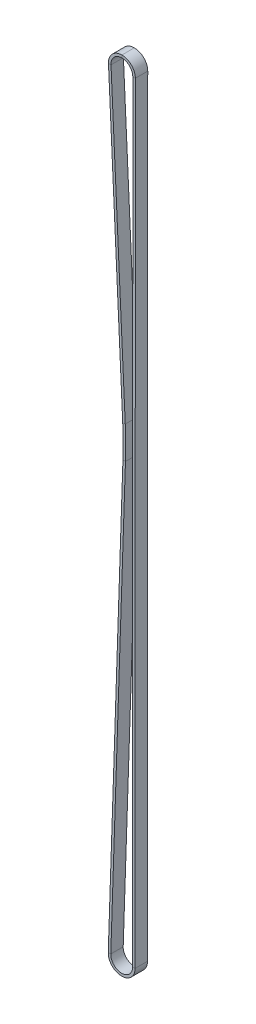
ISO-10303-21;
HEADER;
FILE_DESCRIPTION(('STEP AP214'),'2;1');
FILE_NAME('part.step','',(''),(''),'','','');
FILE_SCHEMA(('AUTOMOTIVE_DESIGN { 1 0 10303 214 1 1 1 1 }'));
ENDSEC;
DATA;
#1=APPLICATION_CONTEXT('core data for automotive mechanical design processes');
#2=APPLICATION_PROTOCOL_DEFINITION('international standard','automotive_design',2000,#1);
#3=PRODUCT_CONTEXT('',#1,'mechanical');
#4=PRODUCT('Part','Part','',(#3));
#5=PRODUCT_RELATED_PRODUCT_CATEGORY('part','',(#4));
#6=PRODUCT_DEFINITION_FORMATION('','',#4);
#7=PRODUCT_DEFINITION_CONTEXT('part definition',#1,'design');
#8=PRODUCT_DEFINITION('design','',#6,#7);
#9=PRODUCT_DEFINITION_SHAPE('','',#8);
#10=(LENGTH_UNIT() NAMED_UNIT(*) SI_UNIT(.MILLI.,.METRE.));
#11=(NAMED_UNIT(*) PLANE_ANGLE_UNIT() SI_UNIT($,.RADIAN.));
#12=(NAMED_UNIT(*) SI_UNIT($,.STERADIAN.) SOLID_ANGLE_UNIT());
#13=UNCERTAINTY_MEASURE_WITH_UNIT(LENGTH_MEASURE(1.E-05),#10,'distance_accuracy_value','');
#14=(GEOMETRIC_REPRESENTATION_CONTEXT(3) GLOBAL_UNCERTAINTY_ASSIGNED_CONTEXT((#13)) GLOBAL_UNIT_ASSIGNED_CONTEXT((#10,
#11,#12)) REPRESENTATION_CONTEXT('',''));
#15=CARTESIAN_POINT('',(0.,0.,0.));
#16=DIRECTION('',(0.,0.,1.));
#17=DIRECTION('',(1.,0.,0.));
#18=AXIS2_PLACEMENT_3D('',#15,#16,#17);
#19=CARTESIAN_POINT('',(0.,0.,0.));
#20=DIRECTION('',(0.,0.,-1.));
#21=DIRECTION('',(-1.,0.,0.));
#22=AXIS2_PLACEMENT_3D('',#19,#20,#21);
#23=CYLINDRICAL_SURFACE('',#22,7.96805699758778);
#24=CARTESIAN_POINT('',(0.,0.,0.));
#25=DIRECTION('',(0.,0.,-1.));
#26=DIRECTION('',(-0.998903282982742,-0.0468212691658441,0.));
#27=AXIS2_PLACEMENT_3D('',#24,#25,#26);
#28=CIRCLE('',#27,7.96805699758778);
#29=CARTESIAN_POINT('',(-7.95931829388405,-0.37307454141286,0.));
#30=VERTEX_POINT('',#29);
#31=CARTESIAN_POINT('',(0.,7.96805699758778,0.));
#32=VERTEX_POINT('',#31);
#33=EDGE_CURVE('E11',#30,#32,#28,.T.);
#34=ORIENTED_EDGE('',*,*,#33,.F.);
#35=DIRECTION('',(0.,0.,1.));
#36=VECTOR('',#35,1.);
#37=CARTESIAN_POINT('',(-7.95931829388405,-0.373074541412847,7.366));
#38=LINE('',#37,#36);
#39=CARTESIAN_POINT('',(-7.95931829388405,-0.37307454141286,7.366));
#40=VERTEX_POINT('',#39);
#41=EDGE_CURVE('E36',#30,#40,#38,.T.);
#42=ORIENTED_EDGE('',*,*,#41,.T.);
#43=CARTESIAN_POINT('',(0.,0.,7.366));
#44=DIRECTION('',(0.,0.,-1.));
#45=DIRECTION('',(-0.998903282982742,-0.0468212691658441,0.));
#46=AXIS2_PLACEMENT_3D('',#43,#44,#45);
#47=CIRCLE('',#46,7.96805699758778);
#48=CARTESIAN_POINT('',(0.,7.96805699758778,7.366));
#49=VERTEX_POINT('',#48);
#50=EDGE_CURVE('E157',#40,#49,#47,.T.);
#51=ORIENTED_EDGE('',*,*,#50,.T.);
#52=DIRECTION('',(0.,0.,1.));
#53=VECTOR('',#52,1.);
#54=CARTESIAN_POINT('',(0.,7.96805699758778,7.366));
#55=LINE('',#54,#53);
#56=EDGE_CURVE('E160',#32,#49,#55,.T.);
#57=ORIENTED_EDGE('',*,*,#56,.F.);
#58=EDGE_LOOP('',(#34,#42,#51,#57));
#59=FACE_BOUND('',#58,.T.);
#60=ADVANCED_FACE('F33',(#59),#23,.T.);
#61=CARTESIAN_POINT('',(-7.95931829388405,-0.373074541412845,0.));
#62=DIRECTION('',(0.,0.,-1.));
#63=DIRECTION('',(-1.,0.,0.));
#64=AXIS2_PLACEMENT_3D('',#61,#62,#63);
#65=PLANE('',#64);
#66=CARTESIAN_POINT('',(0.,0.,0.));
#67=DIRECTION('',(0.,0.,-1.));
#68=DIRECTION('',(-0.998903282982742,-0.0468212691658441,0.));
#69=AXIS2_PLACEMENT_3D('',#66,#67,#68);
#70=CIRCLE('',#69,6.46805699758778);
#71=CARTESIAN_POINT('',(-6.46096336940993,-0.302842637664086,0.));
#72=VERTEX_POINT('',#71);
#73=CARTESIAN_POINT('',(0.,6.46805699758778,0.));
#74=VERTEX_POINT('',#73);
#75=EDGE_CURVE('E41',#72,#74,#70,.T.);
#76=ORIENTED_EDGE('',*,*,#75,.F.);
#77=DIRECTION('',(-0.998903282982742,-0.0468212691658444,0.));
#78=VECTOR('',#77,1.);
#79=CARTESIAN_POINT('',(-7.95931829388405,-0.373074541412847,0.));
#80=LINE('',#79,#78);
#81=EDGE_CURVE('E276',#72,#30,#80,.T.);
#82=ORIENTED_EDGE('',*,*,#81,.T.);
#83=ORIENTED_EDGE('',*,*,#33,.T.);
#84=DIRECTION('',(0.,1.,0.));
#85=VECTOR('',#84,1.);
#86=CARTESIAN_POINT('',(0.,7.96805699758778,0.));
#87=LINE('',#86,#85);
#88=EDGE_CURVE('E185',#74,#32,#87,.T.);
#89=ORIENTED_EDGE('',*,*,#88,.F.);
#90=EDGE_LOOP('',(#76,#82,#83,#89));
#91=FACE_BOUND('',#90,.T.);
#92=ADVANCED_FACE('F371',(#91),#65,.T.);
#93=CARTESIAN_POINT('',(0.,0.,0.));
#94=DIRECTION('',(0.,0.,-1.));
#95=DIRECTION('',(-1.,0.,0.));
#96=AXIS2_PLACEMENT_3D('',#93,#94,#95);
#97=CYLINDRICAL_SURFACE('',#96,6.46805699758778);
#98=CARTESIAN_POINT('',(0.,0.,7.366));
#99=DIRECTION('',(0.,0.,-1.));
#100=DIRECTION('',(-0.998903282982742,-0.0468212691658441,0.));
#101=AXIS2_PLACEMENT_3D('',#98,#99,#100);
#102=CIRCLE('',#101,6.46805699758778);
#103=CARTESIAN_POINT('',(-6.46096336940993,-0.302842637664086,7.366));
#104=VERTEX_POINT('',#103);
#105=CARTESIAN_POINT('',(0.,6.46805699758778,7.366));
#106=VERTEX_POINT('',#105);
#107=EDGE_CURVE('E166',#104,#106,#102,.T.);
#108=ORIENTED_EDGE('',*,*,#107,.F.);
#109=DIRECTION('',(0.,0.,-1.));
#110=VECTOR('',#109,1.);
#111=CARTESIAN_POINT('',(-6.46096336940993,-0.302842637664081,7.366));
#112=LINE('',#111,#110);
#113=EDGE_CURVE('E244',#104,#72,#112,.T.);
#114=ORIENTED_EDGE('',*,*,#113,.T.);
#115=ORIENTED_EDGE('',*,*,#75,.T.);
#116=DIRECTION('',(0.,0.,-1.));
#117=VECTOR('',#116,1.);
#118=CARTESIAN_POINT('',(0.,6.46805699758778,7.366));
#119=LINE('',#118,#117);
#120=EDGE_CURVE('E189',#106,#74,#119,.T.);
#121=ORIENTED_EDGE('',*,*,#120,.F.);
#122=EDGE_LOOP('',(#108,#114,#115,#121));
#123=FACE_BOUND('',#122,.T.);
#124=ADVANCED_FACE('F375',(#123),#97,.F.);
#125=CARTESIAN_POINT('',(0.490311873554149,-180.640791854833,7.366));
#126=DIRECTION('',(-0.998903282982742,-0.0468212691658445,0.));
#127=DIRECTION('',(0.0468212691658445,-0.998903282982742,0.));
#128=AXIS2_PLACEMENT_3D('',#125,#126,#127);
#129=PLANE('',#128);
#130=ORIENTED_EDGE('',*,*,#41,.F.);
#131=DIRECTION('',(-0.0468212691658445,0.998903282982742,0.));
#132=VECTOR('',#131,1.);
#133=CARTESIAN_POINT('',(0.490311873554151,-180.640791854833,0.));
#134=LINE('',#133,#132);
#135=CARTESIAN_POINT('',(0.490311873554222,-180.640791854833,0.));
#136=VERTEX_POINT('',#135);
#137=EDGE_CURVE('E92',#136,#30,#134,.T.);
#138=ORIENTED_EDGE('',*,*,#137,.F.);
#139=DIRECTION('',(0.,0.,1.));
#140=VECTOR('',#139,1.);
#141=CARTESIAN_POINT('',(0.490311873554179,-180.640791854833,7.366));
#142=LINE('',#141,#140);
#143=CARTESIAN_POINT('',(0.490311873554222,-180.640791854833,7.366));
#144=VERTEX_POINT('',#143);
#145=EDGE_CURVE('E247',#136,#144,#142,.T.);
#146=ORIENTED_EDGE('',*,*,#145,.T.);
#147=DIRECTION('',(-0.0468212691658445,0.998903282982742,0.));
#148=VECTOR('',#147,1.);
#149=CARTESIAN_POINT('',(0.490311873554149,-180.640791854833,7.366));
#150=LINE('',#149,#148);
#151=EDGE_CURVE('E242',#144,#40,#150,.T.);
#152=ORIENTED_EDGE('',*,*,#151,.T.);
#153=EDGE_LOOP('',(#130,#138,#146,#152));
#154=FACE_BOUND('',#153,.T.);
#155=ADVANCED_FACE('F308',(#154),#129,.T.);
#156=CARTESIAN_POINT('',(0.490311873554151,-180.640791854833,0.));
#157=DIRECTION('',(0.,0.,-1.));
#158=DIRECTION('',(-1.,0.,0.));
#159=AXIS2_PLACEMENT_3D('',#156,#157,#158);
#160=PLANE('',#159);
#161=ORIENTED_EDGE('',*,*,#137,.T.);
#162=ORIENTED_EDGE('',*,*,#81,.F.);
#163=DIRECTION('',(-0.0468212691658445,0.998903282982742,0.));
#164=VECTOR('',#163,1.);
#165=CARTESIAN_POINT('',(1.98866679802826,-180.570559951085,0.));
#166=LINE('',#165,#164);
#167=CARTESIAN_POINT('',(1.98866679802831,-180.570559951085,0.));
#168=VERTEX_POINT('',#167);
#169=EDGE_CURVE('E101',#168,#72,#166,.T.);
#170=ORIENTED_EDGE('',*,*,#169,.F.);
#171=DIRECTION('',(-0.998903282982742,-0.0468212691658443,0.));
#172=VECTOR('',#171,1.);
#173=CARTESIAN_POINT('',(0.490311873554181,-180.640791854833,0.));
#174=LINE('',#173,#172);
#175=EDGE_CURVE('E272',#168,#136,#174,.T.);
#176=ORIENTED_EDGE('',*,*,#175,.T.);
#177=EDGE_LOOP('',(#161,#162,#170,#176));
#178=FACE_BOUND('',#177,.T.);
#179=ADVANCED_FACE('F383',(#178),#160,.T.);
#180=CARTESIAN_POINT('',(1.98866679802826,-180.570559951085,7.366));
#181=DIRECTION('',(0.998903282982742,0.0468212691658445,0.));
#182=DIRECTION('',(-0.0468212691658445,0.998903282982742,0.));
#183=AXIS2_PLACEMENT_3D('',#180,#181,#182);
#184=PLANE('',#183);
#185=ORIENTED_EDGE('',*,*,#169,.T.);
#186=ORIENTED_EDGE('',*,*,#113,.F.);
#187=DIRECTION('',(-0.0468212691658445,0.998903282982742,0.));
#188=VECTOR('',#187,1.);
#189=CARTESIAN_POINT('',(1.98866679802826,-180.570559951085,7.366));
#190=LINE('',#189,#188);
#191=CARTESIAN_POINT('',(1.98866679802831,-180.570559951085,7.366));
#192=VERTEX_POINT('',#191);
#193=EDGE_CURVE('E109',#192,#104,#190,.T.);
#194=ORIENTED_EDGE('',*,*,#193,.F.);
#195=DIRECTION('',(0.,0.,-1.));
#196=VECTOR('',#195,1.);
#197=CARTESIAN_POINT('',(1.98866679802829,-180.570559951085,7.366));
#198=LINE('',#197,#196);
#199=EDGE_CURVE('E236',#192,#168,#198,.T.);
#200=ORIENTED_EDGE('',*,*,#199,.T.);
#201=EDGE_LOOP('',(#185,#186,#194,#200));
#202=FACE_BOUND('',#201,.T.);
#203=ADVANCED_FACE('F399',(#202),#184,.T.);
#204=CARTESIAN_POINT('',(0.490311873554149,-180.640791854833,7.366));
#205=DIRECTION('',(0.,0.,1.));
#206=DIRECTION('',(1.,0.,0.));
#207=AXIS2_PLACEMENT_3D('',#204,#205,#206);
#208=PLANE('',#207);
#209=ORIENTED_EDGE('',*,*,#193,.T.);
#210=DIRECTION('',(0.998903282982742,0.0468212691658444,0.));
#211=VECTOR('',#210,1.);
#212=CARTESIAN_POINT('',(-7.95931829388405,-0.373074541412847,7.366));
#213=LINE('',#212,#211);
#214=EDGE_CURVE('E240',#40,#104,#213,.T.);
#215=ORIENTED_EDGE('',*,*,#214,.F.);
#216=ORIENTED_EDGE('',*,*,#151,.F.);
#217=DIRECTION('',(0.998903282982742,0.0468212691658443,0.));
#218=VECTOR('',#217,1.);
#219=CARTESIAN_POINT('',(0.490311873554179,-180.640791854833,7.366));
#220=LINE('',#219,#218);
#221=EDGE_CURVE('E231',#144,#192,#220,.T.);
#222=ORIENTED_EDGE('',*,*,#221,.T.);
#223=EDGE_LOOP('',(#209,#215,#216,#222));
#224=FACE_BOUND('',#223,.T.);
#225=ADVANCED_FACE('F394',(#224),#208,.T.);
#226=CARTESIAN_POINT('',(-235.126,-191.684758719327,0.));
#227=DIRECTION('',(0.,0.,1.));
#228=DIRECTION('',(1.,0.,0.));
#229=AXIS2_PLACEMENT_3D('',#226,#227,#228);
#230=CYLINDRICAL_SURFACE('',#229,235.875);
#231=ORIENTED_EDGE('',*,*,#145,.F.);
#232=CARTESIAN_POINT('',(-235.126,-191.684758719327,0.));
#233=DIRECTION('',(0.,0.,1.));
#234=DIRECTION('',(0.999428102416468,-0.0338152051630405,0.));
#235=AXIS2_PLACEMENT_3D('',#232,#233,#234);
#236=CIRCLE('',#235,235.875);
#237=CARTESIAN_POINT('',(0.61410365748428,-199.660920237159,0.));
#238=VERTEX_POINT('',#237);
#239=EDGE_CURVE('E295',#238,#136,#236,.T.);
#240=ORIENTED_EDGE('',*,*,#239,.F.);
#241=DIRECTION('',(0.,0.,1.));
#242=VECTOR('',#241,1.);
#243=CARTESIAN_POINT('',(0.614103657484282,-199.660920237159,7.366));
#244=LINE('',#243,#242);
#245=CARTESIAN_POINT('',(0.614103657484277,-199.660920237159,7.366));
#246=VERTEX_POINT('',#245);
#247=EDGE_CURVE('E239',#238,#246,#244,.T.);
#248=ORIENTED_EDGE('',*,*,#247,.T.);
#249=CARTESIAN_POINT('',(-235.126,-191.684758719327,7.366));
#250=DIRECTION('',(0.,0.,1.));
#251=DIRECTION('',(0.999428102416468,-0.0338152051630405,0.));
#252=AXIS2_PLACEMENT_3D('',#249,#250,#251);
#253=CIRCLE('',#252,235.875);
#254=EDGE_CURVE('E234',#246,#144,#253,.T.);
#255=ORIENTED_EDGE('',*,*,#254,.T.);
#256=EDGE_LOOP('',(#231,#240,#248,#255));
#257=FACE_BOUND('',#256,.T.);
#258=ADVANCED_FACE('F313',(#257),#230,.F.);
#259=CARTESIAN_POINT('',(0.61410365748431,-199.660920237159,0.));
#260=DIRECTION('',(0.,0.,-1.));
#261=DIRECTION('',(-1.,0.,0.));
#262=AXIS2_PLACEMENT_3D('',#259,#260,#261);
#263=PLANE('',#262);
#264=ORIENTED_EDGE('',*,*,#239,.T.);
#265=ORIENTED_EDGE('',*,*,#175,.F.);
#266=CARTESIAN_POINT('',(-235.126,-191.684758719327,0.));
#267=DIRECTION('',(0.,0.,1.));
#268=DIRECTION('',(0.999428102416468,-0.0338152051630406,0.));
#269=AXIS2_PLACEMENT_3D('',#266,#267,#268);
#270=CIRCLE('',#269,237.375);
#271=CARTESIAN_POINT('',(2.11324581110898,-199.711643044904,0.));
#272=VERTEX_POINT('',#271);
#273=EDGE_CURVE('E130',#272,#168,#270,.T.);
#274=ORIENTED_EDGE('',*,*,#273,.F.);
#275=DIRECTION('',(-0.999428102416468,0.0338152051630414,0.));
#276=VECTOR('',#275,1.);
#277=CARTESIAN_POINT('',(0.614103657484284,-199.660920237159,0.));
#278=LINE('',#277,#276);
#279=EDGE_CURVE('E269',#272,#238,#278,.T.);
#280=ORIENTED_EDGE('',*,*,#279,.T.);
#281=EDGE_LOOP('',(#264,#265,#274,#280));
#282=FACE_BOUND('',#281,.T.);
#283=ADVANCED_FACE('F393',(#282),#263,.T.);
#284=CARTESIAN_POINT('',(-235.126,-191.684758719327,0.));
#285=DIRECTION('',(0.,0.,1.));
#286=DIRECTION('',(1.,0.,0.));
#287=AXIS2_PLACEMENT_3D('',#284,#285,#286);
#288=CYLINDRICAL_SURFACE('',#287,237.375);
#289=ORIENTED_EDGE('',*,*,#273,.T.);
#290=ORIENTED_EDGE('',*,*,#199,.F.);
#291=CARTESIAN_POINT('',(-235.126,-191.684758719327,7.366));
#292=DIRECTION('',(0.,0.,1.));
#293=DIRECTION('',(0.999428102416468,-0.0338152051630406,0.));
#294=AXIS2_PLACEMENT_3D('',#291,#292,#293);
#295=CIRCLE('',#294,237.375);
#296=CARTESIAN_POINT('',(2.11324581110898,-199.711643044904,7.366));
#297=VERTEX_POINT('',#296);
#298=EDGE_CURVE('E136',#297,#192,#295,.T.);
#299=ORIENTED_EDGE('',*,*,#298,.F.);
#300=DIRECTION('',(0.,0.,-1.));
#301=VECTOR('',#300,1.);
#302=CARTESIAN_POINT('',(2.11324581110898,-199.711643044904,7.366));
#303=LINE('',#302,#301);
#304=EDGE_CURVE('E227',#297,#272,#303,.T.);
#305=ORIENTED_EDGE('',*,*,#304,.T.);
#306=EDGE_LOOP('',(#289,#290,#299,#305));
#307=FACE_BOUND('',#306,.T.);
#308=ADVANCED_FACE('F404',(#307),#288,.T.);
#309=CARTESIAN_POINT('',(0.614103657484308,-199.660920237159,7.366));
#310=DIRECTION('',(0.,0.,1.));
#311=DIRECTION('',(1.,0.,0.));
#312=AXIS2_PLACEMENT_3D('',#309,#310,#311);
#313=PLANE('',#312);
#314=ORIENTED_EDGE('',*,*,#298,.T.);
#315=ORIENTED_EDGE('',*,*,#221,.F.);
#316=ORIENTED_EDGE('',*,*,#254,.F.);
#317=DIRECTION('',(0.999428102416468,-0.0338152051630414,0.));
#318=VECTOR('',#317,1.);
#319=CARTESIAN_POINT('',(0.614103657484282,-199.660920237159,7.366));
#320=LINE('',#319,#318);
#321=EDGE_CURVE('E220',#246,#297,#320,.T.);
#322=ORIENTED_EDGE('',*,*,#321,.T.);
#323=EDGE_LOOP('',(#314,#315,#316,#322));
#324=FACE_BOUND('',#323,.T.);
#325=ADVANCED_FACE('F311',(#324),#313,.T.);
#326=CARTESIAN_POINT('',(-8.09050008504552,-456.930558517875,7.366));
#327=DIRECTION('',(-0.999428102416468,0.0338152051630413,0.));
#328=DIRECTION('',(-0.0338152051630413,-0.999428102416468,0.));
#329=AXIS2_PLACEMENT_3D('',#326,#327,#328);
#330=PLANE('',#329);
#331=ORIENTED_EDGE('',*,*,#247,.F.);
#332=DIRECTION('',(0.0338152051630413,0.999428102416468,0.));
#333=VECTOR('',#332,1.);
#334=CARTESIAN_POINT('',(-8.09050008504551,-456.930558517875,0.));
#335=LINE('',#334,#333);
#336=CARTESIAN_POINT('',(-8.09050008504551,-456.930558517876,0.));
#337=VERTEX_POINT('',#336);
#338=EDGE_CURVE('E291',#337,#238,#335,.T.);
#339=ORIENTED_EDGE('',*,*,#338,.F.);
#340=DIRECTION('',(0.,0.,1.));
#341=VECTOR('',#340,1.);
#342=CARTESIAN_POINT('',(-8.09050008504552,-456.930558517876,7.366));
#343=LINE('',#342,#341);
#344=CARTESIAN_POINT('',(-8.09050008504552,-456.930558517876,7.366));
#345=VERTEX_POINT('',#344);
#346=EDGE_CURVE('E230',#337,#345,#343,.T.);
#347=ORIENTED_EDGE('',*,*,#346,.T.);
#348=DIRECTION('',(0.0338152051630413,0.999428102416468,0.));
#349=VECTOR('',#348,1.);
#350=CARTESIAN_POINT('',(-8.09050008504552,-456.930558517875,7.366));
#351=LINE('',#350,#349);
#352=EDGE_CURVE('E224',#345,#246,#351,.T.);
#353=ORIENTED_EDGE('',*,*,#352,.T.);
#354=EDGE_LOOP('',(#331,#339,#347,#353));
#355=FACE_BOUND('',#354,.T.);
#356=ADVANCED_FACE('F322',(#355),#330,.T.);
#357=CARTESIAN_POINT('',(-8.09050008504551,-456.930558517875,0.));
#358=DIRECTION('',(0.,0.,-1.));
#359=DIRECTION('',(-1.,0.,0.));
#360=AXIS2_PLACEMENT_3D('',#357,#358,#359);
#361=PLANE('',#360);
#362=ORIENTED_EDGE('',*,*,#338,.T.);
#363=ORIENTED_EDGE('',*,*,#279,.F.);
#364=DIRECTION('',(0.0338152051630413,0.999428102416468,0.));
#365=VECTOR('',#364,1.);
#366=CARTESIAN_POINT('',(-6.59135793142081,-456.98128132562,0.));
#367=LINE('',#366,#365);
#368=CARTESIAN_POINT('',(-6.59135793142081,-456.98128132562,0.));
#369=VERTEX_POINT('',#368);
#370=EDGE_CURVE('E266',#369,#272,#367,.T.);
#371=ORIENTED_EDGE('',*,*,#370,.F.);
#372=DIRECTION('',(-0.999428102416468,0.0338152051630392,0.));
#373=VECTOR('',#372,1.);
#374=CARTESIAN_POINT('',(-8.09050008504551,-456.930558517876,0.));
#375=LINE('',#374,#373);
#376=EDGE_CURVE('E263',#369,#337,#375,.T.);
#377=ORIENTED_EDGE('',*,*,#376,.T.);
#378=EDGE_LOOP('',(#362,#363,#371,#377));
#379=FACE_BOUND('',#378,.T.);
#380=ADVANCED_FACE('F340',(#379),#361,.T.);
#381=CARTESIAN_POINT('',(-6.59135793142081,-456.98128132562,7.366));
#382=DIRECTION('',(0.999428102416468,-0.0338152051630413,0.));
#383=DIRECTION('',(0.0338152051630413,0.999428102416468,0.));
#384=AXIS2_PLACEMENT_3D('',#381,#382,#383);
#385=PLANE('',#384);
#386=ORIENTED_EDGE('',*,*,#370,.T.);
#387=ORIENTED_EDGE('',*,*,#304,.F.);
#388=DIRECTION('',(0.0338152051630413,0.999428102416468,0.));
#389=VECTOR('',#388,1.);
#390=CARTESIAN_POINT('',(-6.59135793142081,-456.98128132562,7.366));
#391=LINE('',#390,#389);
#392=CARTESIAN_POINT('',(-6.59135793142081,-456.98128132562,7.366));
#393=VERTEX_POINT('',#392);
#394=EDGE_CURVE('E223',#393,#297,#391,.T.);
#395=ORIENTED_EDGE('',*,*,#394,.F.);
#396=DIRECTION('',(0.,0.,-1.));
#397=VECTOR('',#396,1.);
#398=CARTESIAN_POINT('',(-6.59135793142081,-456.98128132562,7.366));
#399=LINE('',#398,#397);
#400=EDGE_CURVE('E212',#393,#369,#399,.T.);
#401=ORIENTED_EDGE('',*,*,#400,.T.);
#402=EDGE_LOOP('',(#386,#387,#395,#401));
#403=FACE_BOUND('',#402,.T.);
#404=ADVANCED_FACE('F333',(#403),#385,.T.);
#405=CARTESIAN_POINT('',(-8.09050008504552,-456.930558517875,7.366));
#406=DIRECTION('',(0.,0.,1.));
#407=DIRECTION('',(1.,0.,0.));
#408=AXIS2_PLACEMENT_3D('',#405,#406,#407);
#409=PLANE('',#408);
#410=ORIENTED_EDGE('',*,*,#394,.T.);
#411=ORIENTED_EDGE('',*,*,#321,.F.);
#412=ORIENTED_EDGE('',*,*,#352,.F.);
#413=DIRECTION('',(0.999428102416468,-0.0338152051630392,0.));
#414=VECTOR('',#413,1.);
#415=CARTESIAN_POINT('',(-8.09050008504552,-456.930558517876,7.366));
#416=LINE('',#415,#414);
#417=EDGE_CURVE('E209',#345,#393,#416,.T.);
#418=ORIENTED_EDGE('',*,*,#417,.T.);
#419=EDGE_LOOP('',(#410,#411,#412,#418));
#420=FACE_BOUND('',#419,.T.);
#421=ADVANCED_FACE('F320',(#420),#409,.T.);
#422=CARTESIAN_POINT('',(-0.127000000000099,-457.2,0.));
#423=DIRECTION('',(0.,0.,-1.));
#424=DIRECTION('',(-1.,0.,0.));
#425=AXIS2_PLACEMENT_3D('',#422,#423,#424);
#426=CYLINDRICAL_SURFACE('',#425,7.96805699758778);
#427=ORIENTED_EDGE('',*,*,#346,.F.);
#428=CARTESIAN_POINT('',(-0.127000000000099,-457.2,0.));
#429=DIRECTION('',(0.,0.,-1.));
#430=DIRECTION('',(0.999999961419755,-0.000277777767063725,0.));
#431=AXIS2_PLACEMENT_3D('',#428,#429,#430);
#432=CIRCLE('',#431,7.96805699758778);
#433=CARTESIAN_POINT('',(7.84105669017809,-457.20221334908,0.));
#434=VERTEX_POINT('',#433);
#435=EDGE_CURVE('E213',#434,#337,#432,.T.);
#436=ORIENTED_EDGE('',*,*,#435,.F.);
#437=DIRECTION('',(0.,0.,1.));
#438=VECTOR('',#437,1.);
#439=CARTESIAN_POINT('',(7.8410566901781,-457.20221334908,7.366));
#440=LINE('',#439,#438);
#441=CARTESIAN_POINT('',(7.8410566901781,-457.20221334908,7.366));
#442=VERTEX_POINT('',#441);
#443=EDGE_CURVE('E219',#434,#442,#440,.T.);
#444=ORIENTED_EDGE('',*,*,#443,.T.);
#445=CARTESIAN_POINT('',(-0.127000000000099,-457.2,7.366));
#446=DIRECTION('',(0.,0.,-1.));
#447=DIRECTION('',(0.999999961419755,-0.000277777767063725,0.));
#448=AXIS2_PLACEMENT_3D('',#445,#446,#447);
#449=CIRCLE('',#448,7.96805699758778);
#450=EDGE_CURVE('E217',#442,#345,#449,.T.);
#451=ORIENTED_EDGE('',*,*,#450,.T.);
#452=EDGE_LOOP('',(#427,#436,#444,#451));
#453=FACE_BOUND('',#452,.T.);
#454=ADVANCED_FACE('F343',(#453),#426,.T.);
#455=CARTESIAN_POINT('',(7.84105669017809,-457.20221334908,0.));
#456=DIRECTION('',(0.,0.,-1.));
#457=DIRECTION('',(-1.,0.,0.));
#458=AXIS2_PLACEMENT_3D('',#455,#456,#457);
#459=PLANE('',#458);
#460=ORIENTED_EDGE('',*,*,#435,.T.);
#461=ORIENTED_EDGE('',*,*,#376,.F.);
#462=CARTESIAN_POINT('',(-0.127000000000099,-457.2,0.));
#463=DIRECTION('',(0.,0.,-1.));
#464=DIRECTION('',(0.999999961419755,-0.000277777767058919,0.));
#465=AXIS2_PLACEMENT_3D('',#462,#463,#464);
#466=CIRCLE('',#465,6.46805699758778);
#467=CARTESIAN_POINT('',(6.34105674804846,-457.20179668243,0.));
#468=VERTEX_POINT('',#467);
#469=EDGE_CURVE('E216',#468,#369,#466,.T.);
#470=ORIENTED_EDGE('',*,*,#469,.F.);
#471=DIRECTION('',(0.999999961419755,-0.000277777767061444,0.));
#472=VECTOR('',#471,1.);
#473=CARTESIAN_POINT('',(7.84105669017809,-457.20221334908,0.));
#474=LINE('',#473,#472);
#475=EDGE_CURVE('E260',#468,#434,#474,.T.);
#476=ORIENTED_EDGE('',*,*,#475,.T.);
#477=EDGE_LOOP('',(#460,#461,#470,#476));
#478=FACE_BOUND('',#477,.T.);
#479=ADVANCED_FACE('F341',(#478),#459,.T.);
#480=CARTESIAN_POINT('',(-0.127000000000099,-457.2,0.));
#481=DIRECTION('',(0.,0.,-1.));
#482=DIRECTION('',(-1.,0.,0.));
#483=AXIS2_PLACEMENT_3D('',#480,#481,#482);
#484=CYLINDRICAL_SURFACE('',#483,6.46805699758778);
#485=ORIENTED_EDGE('',*,*,#469,.T.);
#486=ORIENTED_EDGE('',*,*,#400,.F.);
#487=CARTESIAN_POINT('',(-0.127000000000099,-457.2,7.366));
#488=DIRECTION('',(0.,0.,-1.));
#489=DIRECTION('',(0.999999961419755,-0.000277777767058919,0.));
#490=AXIS2_PLACEMENT_3D('',#487,#488,#489);
#491=CIRCLE('',#490,6.46805699758778);
#492=CARTESIAN_POINT('',(6.34105674804846,-457.20179668243,7.366));
#493=VERTEX_POINT('',#492);
#494=EDGE_CURVE('E214',#493,#393,#491,.T.);
#495=ORIENTED_EDGE('',*,*,#494,.F.);
#496=DIRECTION('',(0.,0.,-1.));
#497=VECTOR('',#496,1.);
#498=CARTESIAN_POINT('',(6.34105674804846,-457.20179668243,7.366));
#499=LINE('',#498,#497);
#500=EDGE_CURVE('E205',#493,#468,#499,.T.);
#501=ORIENTED_EDGE('',*,*,#500,.T.);
#502=EDGE_LOOP('',(#485,#486,#495,#501));
#503=FACE_BOUND('',#502,.T.);
#504=ADVANCED_FACE('F334',(#503),#484,.F.);
#505=CARTESIAN_POINT('',(7.8410566901781,-457.20221334908,7.366));
#506=DIRECTION('',(0.,0.,1.));
#507=DIRECTION('',(1.,0.,0.));
#508=AXIS2_PLACEMENT_3D('',#505,#506,#507);
#509=PLANE('',#508);
#510=ORIENTED_EDGE('',*,*,#494,.T.);
#511=ORIENTED_EDGE('',*,*,#417,.F.);
#512=ORIENTED_EDGE('',*,*,#450,.F.);
#513=DIRECTION('',(-0.999999961419755,0.000277777767061444,0.));
#514=VECTOR('',#513,1.);
#515=CARTESIAN_POINT('',(7.8410566901781,-457.20221334908,7.366));
#516=LINE('',#515,#514);
#517=EDGE_CURVE('E198',#442,#493,#516,.T.);
#518=ORIENTED_EDGE('',*,*,#517,.T.);
#519=EDGE_LOOP('',(#510,#511,#512,#518));
#520=FACE_BOUND('',#519,.T.);
#521=ADVANCED_FACE('F327',(#520),#509,.T.);
#522=CARTESIAN_POINT('',(7.9680566901782,-0.00221334908060825,7.366));
#523=DIRECTION('',(0.999999961419755,-0.00027777776706126,0.));
#524=DIRECTION('',(0.00027777776706126,0.999999961419755,0.));
#525=AXIS2_PLACEMENT_3D('',#522,#523,#524);
#526=PLANE('',#525);
#527=ORIENTED_EDGE('',*,*,#443,.F.);
#528=DIRECTION('',(-0.00027777776706126,-0.999999961419755,0.));
#529=VECTOR('',#528,1.);
#530=CARTESIAN_POINT('',(7.96805669017819,-0.00221334908060825,0.));
#531=LINE('',#530,#529);
#532=CARTESIAN_POINT('',(7.96805669017819,-0.00221334908048623,0.));
#533=VERTEX_POINT('',#532);
#534=EDGE_CURVE('E284',#533,#434,#531,.T.);
#535=ORIENTED_EDGE('',*,*,#534,.F.);
#536=DIRECTION('',(0.,0.,1.));
#537=VECTOR('',#536,1.);
#538=CARTESIAN_POINT('',(7.9680566901782,-0.00221334908048642,7.366));
#539=LINE('',#538,#537);
#540=CARTESIAN_POINT('',(7.9680566901782,-0.00221334908048623,7.366));
#541=VERTEX_POINT('',#540);
#542=EDGE_CURVE('E208',#533,#541,#539,.T.);
#543=ORIENTED_EDGE('',*,*,#542,.T.);
#544=DIRECTION('',(-0.00027777776706126,-0.999999961419755,0.));
#545=VECTOR('',#544,1.);
#546=CARTESIAN_POINT('',(7.9680566901782,-0.00221334908060825,7.366));
#547=LINE('',#546,#545);
#548=EDGE_CURVE('E202',#541,#442,#547,.T.);
#549=ORIENTED_EDGE('',*,*,#548,.T.);
#550=EDGE_LOOP('',(#527,#535,#543,#549));
#551=FACE_BOUND('',#550,.T.);
#552=ADVANCED_FACE('F345',(#551),#526,.T.);
#553=CARTESIAN_POINT('',(7.96805669017819,-0.00221334908060825,0.));
#554=DIRECTION('',(0.,0.,-1.));
#555=DIRECTION('',(-1.,0.,0.));
#556=AXIS2_PLACEMENT_3D('',#553,#554,#555);
#557=PLANE('',#556);
#558=ORIENTED_EDGE('',*,*,#534,.T.);
#559=ORIENTED_EDGE('',*,*,#475,.F.);
#560=DIRECTION('',(-0.00027777776706126,-0.999999961419755,0.));
#561=VECTOR('',#560,1.);
#562=CARTESIAN_POINT('',(6.46805674804856,-0.00179668243001608,0.));
#563=LINE('',#562,#561);
#564=CARTESIAN_POINT('',(6.46805674804856,-0.00179668242991704,0.));
#565=VERTEX_POINT('',#564);
#566=EDGE_CURVE('E257',#565,#468,#563,.T.);
#567=ORIENTED_EDGE('',*,*,#566,.F.);
#568=DIRECTION('',(0.999999961419755,-0.000277777767046154,0.));
#569=VECTOR('',#568,1.);
#570=CARTESIAN_POINT('',(7.96805669017819,-0.00221334908048642,0.));
#571=LINE('',#570,#569);
#572=EDGE_CURVE('E254',#565,#533,#571,.T.);
#573=ORIENTED_EDGE('',*,*,#572,.T.);
#574=EDGE_LOOP('',(#558,#559,#567,#573));
#575=FACE_BOUND('',#574,.T.);
#576=ADVANCED_FACE('F347',(#575),#557,.T.);
#577=CARTESIAN_POINT('',(6.46805674804856,-0.00179668243001608,7.366));
#578=DIRECTION('',(-0.999999961419755,0.00027777776706126,0.));
#579=DIRECTION('',(-0.00027777776706126,-0.999999961419755,0.));
#580=AXIS2_PLACEMENT_3D('',#577,#578,#579);
#581=PLANE('',#580);
#582=ORIENTED_EDGE('',*,*,#566,.T.);
#583=ORIENTED_EDGE('',*,*,#500,.F.);
#584=DIRECTION('',(-0.00027777776706126,-0.999999961419755,0.));
#585=VECTOR('',#584,1.);
#586=CARTESIAN_POINT('',(6.46805674804856,-0.00179668243001608,7.366));
#587=LINE('',#586,#585);
#588=CARTESIAN_POINT('',(6.46805674804856,-0.00179668242991704,7.366));
#589=VERTEX_POINT('',#588);
#590=EDGE_CURVE('E201',#589,#493,#587,.T.);
#591=ORIENTED_EDGE('',*,*,#590,.F.);
#592=DIRECTION('',(0.,0.,-1.));
#593=VECTOR('',#592,1.);
#594=CARTESIAN_POINT('',(6.46805674804856,-0.00179668242991718,7.366));
#595=LINE('',#594,#593);
#596=EDGE_CURVE('E196',#589,#565,#595,.T.);
#597=ORIENTED_EDGE('',*,*,#596,.T.);
#598=EDGE_LOOP('',(#582,#583,#591,#597));
#599=FACE_BOUND('',#598,.T.);
#600=ADVANCED_FACE('F357',(#599),#581,.T.);
#601=CARTESIAN_POINT('',(7.9680566901782,-0.00221334908060825,7.366));
#602=DIRECTION('',(0.,0.,1.));
#603=DIRECTION('',(1.,0.,0.));
#604=AXIS2_PLACEMENT_3D('',#601,#602,#603);
#605=PLANE('',#604);
#606=ORIENTED_EDGE('',*,*,#590,.T.);
#607=ORIENTED_EDGE('',*,*,#517,.F.);
#608=ORIENTED_EDGE('',*,*,#548,.F.);
#609=DIRECTION('',(-0.999999961419755,0.000277777767046154,0.));
#610=VECTOR('',#609,1.);
#611=CARTESIAN_POINT('',(7.9680566901782,-0.00221334908048642,7.366));
#612=LINE('',#611,#610);
#613=EDGE_CURVE('E177',#541,#589,#612,.T.);
#614=ORIENTED_EDGE('',*,*,#613,.T.);
#615=EDGE_LOOP('',(#606,#607,#608,#614));
#616=FACE_BOUND('',#615,.T.);
#617=ADVANCED_FACE('F359',(#616),#605,.T.);
#618=CARTESIAN_POINT('',(0.,0.,0.));
#619=DIRECTION('',(0.,0.,-1.));
#620=DIRECTION('',(-1.,0.,0.));
#621=AXIS2_PLACEMENT_3D('',#618,#619,#620);
#622=CYLINDRICAL_SURFACE('',#621,7.96805699758778);
#623=ORIENTED_EDGE('',*,*,#542,.F.);
#624=CARTESIAN_POINT('',(0.,0.,0.));
#625=DIRECTION('',(0.,0.,-1.));
#626=DIRECTION('',(0.,1.,0.));
#627=AXIS2_PLACEMENT_3D('',#624,#625,#626);
#628=CIRCLE('',#627,7.96805699758778);
#629=EDGE_CURVE('E184',#32,#533,#628,.T.);
#630=ORIENTED_EDGE('',*,*,#629,.F.);
#631=ORIENTED_EDGE('',*,*,#56,.T.);
#632=CARTESIAN_POINT('',(0.,0.,7.366));
#633=DIRECTION('',(0.,0.,-1.));
#634=DIRECTION('',(0.,1.,0.));
#635=AXIS2_PLACEMENT_3D('',#632,#633,#634);
#636=CIRCLE('',#635,7.96805699758778);
#637=EDGE_CURVE('E172',#49,#541,#636,.T.);
#638=ORIENTED_EDGE('',*,*,#637,.T.);
#639=EDGE_LOOP('',(#623,#630,#631,#638));
#640=FACE_BOUND('',#639,.T.);
#641=ADVANCED_FACE('F182',(#640),#622,.T.);
#642=CARTESIAN_POINT('',(0.,7.96805699758778,0.));
#643=DIRECTION('',(0.,0.,-1.));
#644=DIRECTION('',(-1.,0.,0.));
#645=AXIS2_PLACEMENT_3D('',#642,#643,#644);
#646=PLANE('',#645);
#647=ORIENTED_EDGE('',*,*,#629,.T.);
#648=ORIENTED_EDGE('',*,*,#572,.F.);
#649=CARTESIAN_POINT('',(0.,0.,0.));
#650=DIRECTION('',(0.,0.,-1.));
#651=DIRECTION('',(0.,1.,0.));
#652=AXIS2_PLACEMENT_3D('',#649,#650,#651);
#653=CIRCLE('',#652,6.46805699758778);
#654=EDGE_CURVE('E251',#74,#565,#653,.T.);
#655=ORIENTED_EDGE('',*,*,#654,.F.);
#656=ORIENTED_EDGE('',*,*,#88,.T.);
#657=EDGE_LOOP('',(#647,#648,#655,#656));
#658=FACE_BOUND('',#657,.T.);
#659=ADVANCED_FACE('F351',(#658),#646,.T.);
#660=CARTESIAN_POINT('',(0.,0.,0.));
#661=DIRECTION('',(0.,0.,-1.));
#662=DIRECTION('',(-1.,0.,0.));
#663=AXIS2_PLACEMENT_3D('',#660,#661,#662);
#664=CYLINDRICAL_SURFACE('',#663,6.46805699758778);
#665=ORIENTED_EDGE('',*,*,#654,.T.);
#666=ORIENTED_EDGE('',*,*,#596,.F.);
#667=CARTESIAN_POINT('',(0.,0.,7.366));
#668=DIRECTION('',(0.,0.,-1.));
#669=DIRECTION('',(0.,1.,0.));
#670=AXIS2_PLACEMENT_3D('',#667,#668,#669);
#671=CIRCLE('',#670,6.46805699758778);
#672=EDGE_CURVE('E195',#106,#589,#671,.T.);
#673=ORIENTED_EDGE('',*,*,#672,.F.);
#674=ORIENTED_EDGE('',*,*,#120,.T.);
#675=EDGE_LOOP('',(#665,#666,#673,#674));
#676=FACE_BOUND('',#675,.T.);
#677=ADVANCED_FACE('F354',(#676),#664,.F.);
#678=CARTESIAN_POINT('',(0.,7.96805699758778,7.366));
#679=DIRECTION('',(0.,0.,1.));
#680=DIRECTION('',(1.,0.,0.));
#681=AXIS2_PLACEMENT_3D('',#678,#679,#680);
#682=PLANE('',#681);
#683=ORIENTED_EDGE('',*,*,#672,.T.);
#684=ORIENTED_EDGE('',*,*,#613,.F.);
#685=ORIENTED_EDGE('',*,*,#637,.F.);
#686=DIRECTION('',(0.,-1.,0.));
#687=VECTOR('',#686,1.);
#688=CARTESIAN_POINT('',(0.,7.96805699758778,7.366));
#689=LINE('',#688,#687);
#690=EDGE_CURVE('E175',#49,#106,#689,.T.);
#691=ORIENTED_EDGE('',*,*,#690,.T.);
#692=EDGE_LOOP('',(#683,#684,#685,#691));
#693=FACE_BOUND('',#692,.T.);
#694=ADVANCED_FACE('F174',(#693),#682,.T.);
#695=CARTESIAN_POINT('',(-7.95931829388405,-0.373074541412845,7.366));
#696=DIRECTION('',(0.,0.,1.));
#697=DIRECTION('',(1.,0.,0.));
#698=AXIS2_PLACEMENT_3D('',#695,#696,#697);
#699=PLANE('',#698);
#700=ORIENTED_EDGE('',*,*,#214,.T.);
#701=ORIENTED_EDGE('',*,*,#107,.T.);
#702=ORIENTED_EDGE('',*,*,#690,.F.);
#703=ORIENTED_EDGE('',*,*,#50,.F.);
#704=EDGE_LOOP('',(#700,#701,#702,#703));
#705=FACE_BOUND('',#704,.T.);
#706=ADVANCED_FACE('F187',(#705),#699,.T.);
#707=CLOSED_SHELL('',(#60,#92,#124,#155,#179,#203,#225,#258,#283,#308,#325,#356,#380,#404,#421,
#454,#479,#504,#521,#552,#576,#600,#617,#641,#659,#677,#694,#706));
#708=MANIFOLD_SOLID_BREP('B2',#707);
#709=ADVANCED_BREP_SHAPE_REPRESENTATION('',(#18,#708),#14);
#710=SHAPE_DEFINITION_REPRESENTATION(#9,#709);
ENDSEC;
END-ISO-10303-21;
